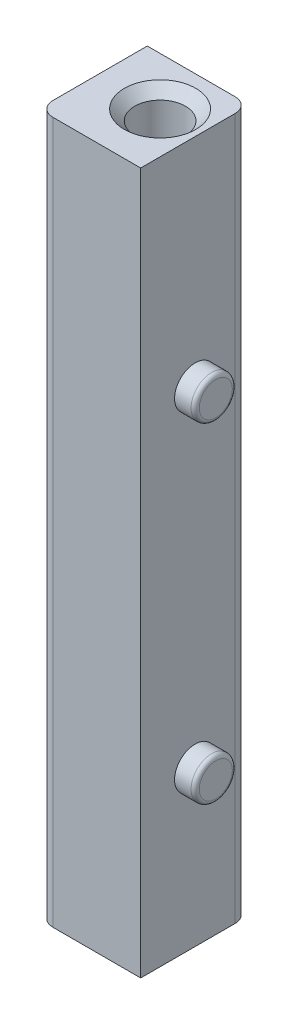
ISO-10303-21;
HEADER;
FILE_DESCRIPTION(('STEP AP214'),'2;1');
FILE_NAME('part.step','',(''),(''),'','','');
FILE_SCHEMA(('AUTOMOTIVE_DESIGN { 1 0 10303 214 1 1 1 1 }'));
ENDSEC;
DATA;
#1=APPLICATION_CONTEXT('core data for automotive mechanical design processes');
#2=APPLICATION_PROTOCOL_DEFINITION('international standard','automotive_design',2000,#1);
#3=PRODUCT_CONTEXT('',#1,'mechanical');
#4=PRODUCT('Part','Part','',(#3));
#5=PRODUCT_RELATED_PRODUCT_CATEGORY('part','',(#4));
#6=PRODUCT_DEFINITION_FORMATION('','',#4);
#7=PRODUCT_DEFINITION_CONTEXT('part definition',#1,'design');
#8=PRODUCT_DEFINITION('design','',#6,#7);
#9=PRODUCT_DEFINITION_SHAPE('','',#8);
#10=(LENGTH_UNIT() NAMED_UNIT(*) SI_UNIT(.MILLI.,.METRE.));
#11=(NAMED_UNIT(*) PLANE_ANGLE_UNIT() SI_UNIT($,.RADIAN.));
#12=(NAMED_UNIT(*) SI_UNIT($,.STERADIAN.) SOLID_ANGLE_UNIT());
#13=UNCERTAINTY_MEASURE_WITH_UNIT(LENGTH_MEASURE(1.E-05),#10,'distance_accuracy_value','');
#14=(GEOMETRIC_REPRESENTATION_CONTEXT(3) GLOBAL_UNCERTAINTY_ASSIGNED_CONTEXT((#13)) GLOBAL_UNIT_ASSIGNED_CONTEXT((#10,
#11,#12)) REPRESENTATION_CONTEXT('',''));
#15=CARTESIAN_POINT('',(0.,0.,0.));
#16=DIRECTION('',(0.,0.,1.));
#17=DIRECTION('',(1.,0.,0.));
#18=AXIS2_PLACEMENT_3D('',#15,#16,#17);
#19=CARTESIAN_POINT('',(5.1054,-39.37,-5.9182));
#20=DIRECTION('',(1.,0.,0.));
#21=DIRECTION('',(0.,0.,-1.));
#22=AXIS2_PLACEMENT_3D('',#19,#20,#21);
#23=PLANE('',#22);
#24=CARTESIAN_POINT('',(5.1054,20.32,0.787400000000002));
#25=DIRECTION('',(1.,0.,0.));
#26=DIRECTION('',(0.,0.,-1.));
#27=AXIS2_PLACEMENT_3D('',#24,#25,#26);
#28=CIRCLE('',#27,2.54);
#29=CARTESIAN_POINT('',(5.1054,20.32,-1.7526));
#30=VERTEX_POINT('',#29);
#31=EDGE_CURVE('E133',#30,#30,#28,.T.);
#32=ORIENTED_EDGE('',*,*,#31,.F.);
#33=EDGE_LOOP('',(#32));
#34=FACE_BOUND('',#33,.T.);
#35=DIRECTION('',(0.,0.,-1.));
#36=VECTOR('',#35,1.);
#37=CARTESIAN_POINT('',(5.1054,-39.37,-5.9182));
#38=LINE('',#37,#36);
#39=CARTESIAN_POINT('',(5.1054,-39.37,7.493));
#40=VERTEX_POINT('',#39);
#41=CARTESIAN_POINT('',(5.1054,-39.37,-4.1402));
#42=VERTEX_POINT('',#41);
#43=EDGE_CURVE('E122',#40,#42,#38,.T.);
#44=ORIENTED_EDGE('',*,*,#43,.T.);
#45=DIRECTION('',(0.,1.,0.));
#46=VECTOR('',#45,1.);
#47=CARTESIAN_POINT('',(5.1054,-39.37,-4.1402));
#48=LINE('',#47,#46);
#49=CARTESIAN_POINT('',(5.1054,46.99,-4.1402));
#50=VERTEX_POINT('',#49);
#51=EDGE_CURVE('E112',#42,#50,#48,.T.);
#52=ORIENTED_EDGE('',*,*,#51,.T.);
#53=DIRECTION('',(0.,0.,-1.));
#54=VECTOR('',#53,1.);
#55=CARTESIAN_POINT('',(5.1054,46.99,-5.9182));
#56=LINE('',#55,#54);
#57=CARTESIAN_POINT('',(5.1054,46.99,7.493));
#58=VERTEX_POINT('',#57);
#59=EDGE_CURVE('E94',#58,#50,#56,.T.);
#60=ORIENTED_EDGE('',*,*,#59,.F.);
#61=DIRECTION('',(0.,1.,0.));
#62=VECTOR('',#61,1.);
#63=CARTESIAN_POINT('',(5.1054,-39.37,7.493));
#64=LINE('',#63,#62);
#65=EDGE_CURVE('E101',#40,#58,#64,.T.);
#66=ORIENTED_EDGE('',*,*,#65,.F.);
#67=EDGE_LOOP('',(#44,#52,#60,#66));
#68=FACE_BOUND('',#67,.T.);
#69=CARTESIAN_POINT('',(5.1054,-20.32,0.787400000000002));
#70=DIRECTION('',(1.,0.,0.));
#71=DIRECTION('',(0.,0.,-1.));
#72=AXIS2_PLACEMENT_3D('',#69,#70,#71);
#73=CIRCLE('',#72,2.54);
#74=CARTESIAN_POINT('',(5.1054,-20.32,-1.7526));
#75=VERTEX_POINT('',#74);
#76=EDGE_CURVE('E208',#75,#75,#73,.T.);
#77=ORIENTED_EDGE('',*,*,#76,.F.);
#78=EDGE_LOOP('',(#77));
#79=FACE_BOUND('',#78,.T.);
#80=ADVANCED_FACE('F34',(#34,#68,#79),#23,.T.);
#81=CARTESIAN_POINT('',(-7.493,-39.37,-5.9182));
#82=DIRECTION('',(-1.,0.,0.));
#83=DIRECTION('',(0.,0.,1.));
#84=AXIS2_PLACEMENT_3D('',#81,#82,#83);
#85=PLANE('',#84);
#86=DIRECTION('',(0.,0.,1.));
#87=VECTOR('',#86,1.);
#88=CARTESIAN_POINT('',(-7.493,-39.37,-5.9182));
#89=LINE('',#88,#87);
#90=CARTESIAN_POINT('',(-7.493,-39.37,-5.9182));
#91=VERTEX_POINT('',#90);
#92=CARTESIAN_POINT('',(-7.493,-39.37,5.715));
#93=VERTEX_POINT('',#92);
#94=EDGE_CURVE('E115',#91,#93,#89,.T.);
#95=ORIENTED_EDGE('',*,*,#94,.T.);
#96=DIRECTION('',(0.,1.,0.));
#97=VECTOR('',#96,1.);
#98=CARTESIAN_POINT('',(-7.493,-39.37,5.715));
#99=LINE('',#98,#97);
#100=CARTESIAN_POINT('',(-7.493,46.99,5.715));
#101=VERTEX_POINT('',#100);
#102=EDGE_CURVE('E142',#93,#101,#99,.T.);
#103=ORIENTED_EDGE('',*,*,#102,.T.);
#104=DIRECTION('',(0.,0.,1.));
#105=VECTOR('',#104,1.);
#106=CARTESIAN_POINT('',(-7.493,46.99,-5.9182));
#107=LINE('',#106,#105);
#108=CARTESIAN_POINT('',(-7.493,46.99,-5.9182));
#109=VERTEX_POINT('',#108);
#110=EDGE_CURVE('E98',#109,#101,#107,.T.);
#111=ORIENTED_EDGE('',*,*,#110,.F.);
#112=DIRECTION('',(0.,1.,0.));
#113=VECTOR('',#112,1.);
#114=CARTESIAN_POINT('',(-7.493,-39.37,-5.9182));
#115=LINE('',#114,#113);
#116=EDGE_CURVE('E106',#91,#109,#115,.T.);
#117=ORIENTED_EDGE('',*,*,#116,.F.);
#118=EDGE_LOOP('',(#95,#103,#111,#117));
#119=FACE_BOUND('',#118,.T.);
#120=ADVANCED_FACE('F170',(#119),#85,.T.);
#121=CARTESIAN_POINT('',(-7.493,-39.37,-5.9182));
#122=DIRECTION('',(0.,0.,-1.));
#123=DIRECTION('',(-1.,0.,0.));
#124=AXIS2_PLACEMENT_3D('',#121,#122,#123);
#125=PLANE('',#124);
#126=DIRECTION('',(-1.,0.,0.));
#127=VECTOR('',#126,1.);
#128=CARTESIAN_POINT('',(-7.493,46.99,-5.9182));
#129=LINE('',#128,#127);
#130=CARTESIAN_POINT('',(3.3274,46.99,-5.9182));
#131=VERTEX_POINT('',#130);
#132=EDGE_CURVE('E113',#131,#109,#129,.T.);
#133=ORIENTED_EDGE('',*,*,#132,.F.);
#134=DIRECTION('',(0.,1.,0.));
#135=VECTOR('',#134,1.);
#136=CARTESIAN_POINT('',(3.3274,-39.37,-5.9182));
#137=LINE('',#136,#135);
#138=CARTESIAN_POINT('',(3.3274,-39.37,-5.9182));
#139=VERTEX_POINT('',#138);
#140=EDGE_CURVE('E57',#131,#139,#137,.F.);
#141=ORIENTED_EDGE('',*,*,#140,.T.);
#142=DIRECTION('',(-1.,0.,0.));
#143=VECTOR('',#142,1.);
#144=CARTESIAN_POINT('',(-7.493,-39.37,-5.9182));
#145=LINE('',#144,#143);
#146=EDGE_CURVE('E107',#139,#91,#145,.T.);
#147=ORIENTED_EDGE('',*,*,#146,.T.);
#148=ORIENTED_EDGE('',*,*,#116,.T.);
#149=EDGE_LOOP('',(#133,#141,#147,#148));
#150=FACE_BOUND('',#149,.T.);
#151=ADVANCED_FACE('F176',(#150),#125,.T.);
#152=CARTESIAN_POINT('',(-7.493,-39.37,7.493));
#153=DIRECTION('',(0.,0.,1.));
#154=DIRECTION('',(1.,0.,0.));
#155=AXIS2_PLACEMENT_3D('',#152,#153,#154);
#156=PLANE('',#155);
#157=DIRECTION('',(1.,0.,0.));
#158=VECTOR('',#157,1.);
#159=CARTESIAN_POINT('',(-7.493,46.99,7.493));
#160=LINE('',#159,#158);
#161=CARTESIAN_POINT('',(-5.715,46.99,7.493));
#162=VERTEX_POINT('',#161);
#163=EDGE_CURVE('E89',#162,#58,#160,.T.);
#164=ORIENTED_EDGE('',*,*,#163,.F.);
#165=DIRECTION('',(0.,1.,0.));
#166=VECTOR('',#165,1.);
#167=CARTESIAN_POINT('',(-5.715,-39.37,7.493));
#168=LINE('',#167,#166);
#169=CARTESIAN_POINT('',(-5.715,-39.37,7.493));
#170=VERTEX_POINT('',#169);
#171=EDGE_CURVE('E148',#162,#170,#168,.F.);
#172=ORIENTED_EDGE('',*,*,#171,.T.);
#173=DIRECTION('',(1.,0.,0.));
#174=VECTOR('',#173,1.);
#175=CARTESIAN_POINT('',(-7.493,-39.37,7.493));
#176=LINE('',#175,#174);
#177=EDGE_CURVE('E104',#170,#40,#176,.T.);
#178=ORIENTED_EDGE('',*,*,#177,.T.);
#179=ORIENTED_EDGE('',*,*,#65,.T.);
#180=EDGE_LOOP('',(#164,#172,#178,#179));
#181=FACE_BOUND('',#180,.T.);
#182=ADVANCED_FACE('F102',(#181),#156,.T.);
#183=CARTESIAN_POINT('',(-7.493,-39.37,7.493));
#184=DIRECTION('',(0.,1.,0.));
#185=DIRECTION('',(0.,0.,1.));
#186=AXIS2_PLACEMENT_3D('',#183,#184,#185);
#187=PLANE('',#186);
#188=CARTESIAN_POINT('',(0.,-39.37,0.));
#189=DIRECTION('',(0.,1.,0.));
#190=DIRECTION('',(0.,0.,1.));
#191=AXIS2_PLACEMENT_3D('',#188,#189,#190);
#192=CIRCLE('',#191,3.1242);
#193=CARTESIAN_POINT('',(0.,-39.37,3.1242));
#194=VERTEX_POINT('',#193);
#195=EDGE_CURVE('E206',#194,#194,#192,.T.);
#196=ORIENTED_EDGE('',*,*,#195,.T.);
#197=EDGE_LOOP('',(#196));
#198=FACE_BOUND('',#197,.T.);
#199=ORIENTED_EDGE('',*,*,#177,.F.);
#200=CARTESIAN_POINT('',(-5.715,-39.37,5.715));
#201=DIRECTION('',(0.,1.,0.));
#202=DIRECTION('',(0.,0.,1.));
#203=AXIS2_PLACEMENT_3D('',#200,#201,#202);
#204=CIRCLE('',#203,1.778);
#205=EDGE_CURVE('E151',#170,#93,#204,.F.);
#206=ORIENTED_EDGE('',*,*,#205,.T.);
#207=ORIENTED_EDGE('',*,*,#94,.F.);
#208=ORIENTED_EDGE('',*,*,#146,.F.);
#209=CARTESIAN_POINT('',(3.3274,-39.37,-4.1402));
#210=DIRECTION('',(0.,1.,0.));
#211=DIRECTION('',(0.,0.,1.));
#212=AXIS2_PLACEMENT_3D('',#209,#210,#211);
#213=CIRCLE('',#212,1.778);
#214=EDGE_CURVE('E49',#139,#42,#213,.F.);
#215=ORIENTED_EDGE('',*,*,#214,.T.);
#216=ORIENTED_EDGE('',*,*,#43,.F.);
#217=EDGE_LOOP('',(#199,#206,#207,#208,#215,#216));
#218=FACE_BOUND('',#217,.T.);
#219=ADVANCED_FACE('F184',(#198,#218),#187,.F.);
#220=CARTESIAN_POINT('',(-7.493,46.99,7.493));
#221=DIRECTION('',(0.,1.,0.));
#222=DIRECTION('',(0.,0.,1.));
#223=AXIS2_PLACEMENT_3D('',#220,#221,#222);
#224=PLANE('',#223);
#225=CARTESIAN_POINT('',(0.,46.99,0.));
#226=DIRECTION('',(0.,1.,0.));
#227=DIRECTION('',(0.,0.,1.));
#228=AXIS2_PLACEMENT_3D('',#225,#226,#227);
#229=CIRCLE('',#228,4.39419999999997);
#230=CARTESIAN_POINT('',(0.,46.99,4.39419999999997));
#231=VERTEX_POINT('',#230);
#232=EDGE_CURVE('E11',#231,#231,#229,.F.);
#233=ORIENTED_EDGE('',*,*,#232,.T.);
#234=EDGE_LOOP('',(#233));
#235=FACE_BOUND('',#234,.T.);
#236=ORIENTED_EDGE('',*,*,#110,.T.);
#237=CARTESIAN_POINT('',(-5.715,46.99,5.715));
#238=DIRECTION('',(0.,1.,0.));
#239=DIRECTION('',(0.,0.,1.));
#240=AXIS2_PLACEMENT_3D('',#237,#238,#239);
#241=CIRCLE('',#240,1.778);
#242=EDGE_CURVE('E95',#101,#162,#241,.T.);
#243=ORIENTED_EDGE('',*,*,#242,.T.);
#244=ORIENTED_EDGE('',*,*,#163,.T.);
#245=ORIENTED_EDGE('',*,*,#59,.T.);
#246=CARTESIAN_POINT('',(3.3274,46.99,-4.1402));
#247=DIRECTION('',(0.,1.,0.));
#248=DIRECTION('',(0.,0.,1.));
#249=AXIS2_PLACEMENT_3D('',#246,#247,#248);
#250=CIRCLE('',#249,1.778);
#251=EDGE_CURVE('E145',#50,#131,#250,.T.);
#252=ORIENTED_EDGE('',*,*,#251,.T.);
#253=ORIENTED_EDGE('',*,*,#132,.T.);
#254=EDGE_LOOP('',(#236,#243,#244,#245,#252,#253));
#255=FACE_BOUND('',#254,.T.);
#256=ADVANCED_FACE('F92',(#235,#255),#224,.T.);
#257=CARTESIAN_POINT('',(0.,-39.37,0.));
#258=DIRECTION('',(0.,1.,0.));
#259=DIRECTION('',(0.,0.,1.));
#260=AXIS2_PLACEMENT_3D('',#257,#258,#259);
#261=CYLINDRICAL_SURFACE('',#260,3.1242);
#262=CARTESIAN_POINT('',(0.,45.72,0.));
#263=DIRECTION('',(0.,1.,0.));
#264=DIRECTION('',(0.,0.,1.));
#265=AXIS2_PLACEMENT_3D('',#262,#263,#264);
#266=CIRCLE('',#265,3.1242);
#267=CARTESIAN_POINT('',(0.,45.72,3.1242));
#268=VERTEX_POINT('',#267);
#269=EDGE_CURVE('E42',#268,#268,#266,.T.);
#270=ORIENTED_EDGE('',*,*,#269,.T.);
#271=EDGE_LOOP('',(#270));
#272=FACE_BOUND('',#271,.T.);
#273=ORIENTED_EDGE('',*,*,#195,.F.);
#274=EDGE_LOOP('',(#273));
#275=FACE_BOUND('',#274,.T.);
#276=ADVANCED_FACE('F157',(#272,#275),#261,.F.);
#277=CARTESIAN_POINT('',(7.6454,-20.32,0.787400000000002));
#278=DIRECTION('',(-1.,0.,0.));
#279=DIRECTION('',(0.,0.,1.));
#280=AXIS2_PLACEMENT_3D('',#277,#278,#279);
#281=CYLINDRICAL_SURFACE('',#280,2.54);
#282=CARTESIAN_POINT('',(7.1374,-20.32,0.787400000000002));
#283=DIRECTION('',(1.,0.,0.));
#284=DIRECTION('',(0.,0.,-1.));
#285=AXIS2_PLACEMENT_3D('',#282,#283,#284);
#286=CIRCLE('',#285,2.54);
#287=CARTESIAN_POINT('',(7.1374,-20.32,-1.7526));
#288=VERTEX_POINT('',#287);
#289=EDGE_CURVE('E130',#288,#288,#286,.F.);
#290=ORIENTED_EDGE('',*,*,#289,.T.);
#291=EDGE_LOOP('',(#290));
#292=FACE_BOUND('',#291,.T.);
#293=ORIENTED_EDGE('',*,*,#76,.T.);
#294=EDGE_LOOP('',(#293));
#295=FACE_BOUND('',#294,.T.);
#296=ADVANCED_FACE('F214',(#292,#295),#281,.T.);
#297=CARTESIAN_POINT('',(7.6454,-20.32,0.787400000000002));
#298=DIRECTION('',(1.,0.,0.));
#299=DIRECTION('',(0.,0.,-1.));
#300=AXIS2_PLACEMENT_3D('',#297,#298,#299);
#301=PLANE('',#300);
#302=CARTESIAN_POINT('',(7.6454,-20.32,0.787400000000002));
#303=DIRECTION('',(1.,0.,0.));
#304=DIRECTION('',(0.,0.,-1.));
#305=AXIS2_PLACEMENT_3D('',#302,#303,#304);
#306=CIRCLE('',#305,2.032);
#307=CARTESIAN_POINT('',(7.6454,-20.32,-1.2446));
#308=VERTEX_POINT('',#307);
#309=EDGE_CURVE('E126',#308,#308,#306,.T.);
#310=ORIENTED_EDGE('',*,*,#309,.T.);
#311=EDGE_LOOP('',(#310));
#312=FACE_BOUND('',#311,.T.);
#313=ADVANCED_FACE('F190',(#312),#301,.T.);
#314=CARTESIAN_POINT('',(7.1374,-20.32,0.787400000000002));
#315=DIRECTION('',(1.,0.,0.));
#316=DIRECTION('',(0.,0.,-1.));
#317=AXIS2_PLACEMENT_3D('',#314,#315,#316);
#318=TOROIDAL_SURFACE('',#317,2.032,0.508);
#319=ORIENTED_EDGE('',*,*,#289,.F.);
#320=EDGE_LOOP('',(#319));
#321=FACE_BOUND('',#320,.T.);
#322=ORIENTED_EDGE('',*,*,#309,.F.);
#323=EDGE_LOOP('',(#322));
#324=FACE_BOUND('',#323,.T.);
#325=ADVANCED_FACE('F186',(#321,#324),#318,.T.);
#326=CARTESIAN_POINT('',(7.6454,20.32,0.787400000000002));
#327=DIRECTION('',(-1.,0.,0.));
#328=DIRECTION('',(0.,0.,1.));
#329=AXIS2_PLACEMENT_3D('',#326,#327,#328);
#330=CYLINDRICAL_SURFACE('',#329,2.54);
#331=CARTESIAN_POINT('',(7.1374,20.32,0.787400000000002));
#332=DIRECTION('',(1.,0.,0.));
#333=DIRECTION('',(0.,0.,-1.));
#334=AXIS2_PLACEMENT_3D('',#331,#332,#333);
#335=CIRCLE('',#334,2.54);
#336=CARTESIAN_POINT('',(7.1374,20.32,-1.7526));
#337=VERTEX_POINT('',#336);
#338=EDGE_CURVE('E136',#337,#337,#335,.F.);
#339=ORIENTED_EDGE('',*,*,#338,.T.);
#340=EDGE_LOOP('',(#339));
#341=FACE_BOUND('',#340,.T.);
#342=ORIENTED_EDGE('',*,*,#31,.T.);
#343=EDGE_LOOP('',(#342));
#344=FACE_BOUND('',#343,.T.);
#345=ADVANCED_FACE('F189',(#341,#344),#330,.T.);
#346=CARTESIAN_POINT('',(7.6454,20.32,0.787400000000002));
#347=DIRECTION('',(1.,0.,0.));
#348=DIRECTION('',(0.,0.,-1.));
#349=AXIS2_PLACEMENT_3D('',#346,#347,#348);
#350=PLANE('',#349);
#351=CARTESIAN_POINT('',(7.6454,20.32,0.787400000000002));
#352=DIRECTION('',(1.,0.,0.));
#353=DIRECTION('',(0.,0.,-1.));
#354=AXIS2_PLACEMENT_3D('',#351,#352,#353);
#355=CIRCLE('',#354,2.032);
#356=CARTESIAN_POINT('',(7.6454,20.32,-1.2446));
#357=VERTEX_POINT('',#356);
#358=EDGE_CURVE('E139',#357,#357,#355,.T.);
#359=ORIENTED_EDGE('',*,*,#358,.T.);
#360=EDGE_LOOP('',(#359));
#361=FACE_BOUND('',#360,.T.);
#362=ADVANCED_FACE('F195',(#361),#350,.T.);
#363=CARTESIAN_POINT('',(7.1374,20.32,0.787400000000002));
#364=DIRECTION('',(1.,0.,0.));
#365=DIRECTION('',(0.,0.,-1.));
#366=AXIS2_PLACEMENT_3D('',#363,#364,#365);
#367=TOROIDAL_SURFACE('',#366,2.032,0.508);
#368=ORIENTED_EDGE('',*,*,#358,.F.);
#369=EDGE_LOOP('',(#368));
#370=FACE_BOUND('',#369,.T.);
#371=ORIENTED_EDGE('',*,*,#338,.F.);
#372=EDGE_LOOP('',(#371));
#373=FACE_BOUND('',#372,.T.);
#374=ADVANCED_FACE('F192',(#370,#373),#367,.T.);
#375=CARTESIAN_POINT('',(-5.715,-39.37,5.715));
#376=DIRECTION('',(0.,1.,0.));
#377=DIRECTION('',(0.,0.,1.));
#378=AXIS2_PLACEMENT_3D('',#375,#376,#377);
#379=CYLINDRICAL_SURFACE('',#378,1.778);
#380=ORIENTED_EDGE('',*,*,#205,.F.);
#381=ORIENTED_EDGE('',*,*,#171,.F.);
#382=ORIENTED_EDGE('',*,*,#242,.F.);
#383=ORIENTED_EDGE('',*,*,#102,.F.);
#384=EDGE_LOOP('',(#380,#381,#382,#383));
#385=FACE_BOUND('',#384,.T.);
#386=ADVANCED_FACE('F166',(#385),#379,.T.);
#387=CARTESIAN_POINT('',(3.3274,-39.37,-4.1402));
#388=DIRECTION('',(0.,1.,0.));
#389=DIRECTION('',(0.,0.,1.));
#390=AXIS2_PLACEMENT_3D('',#387,#388,#389);
#391=CYLINDRICAL_SURFACE('',#390,1.778);
#392=ORIENTED_EDGE('',*,*,#214,.F.);
#393=ORIENTED_EDGE('',*,*,#140,.F.);
#394=ORIENTED_EDGE('',*,*,#251,.F.);
#395=ORIENTED_EDGE('',*,*,#51,.F.);
#396=EDGE_LOOP('',(#392,#393,#394,#395));
#397=FACE_BOUND('',#396,.T.);
#398=ADVANCED_FACE('F161',(#397),#391,.T.);
#399=CARTESIAN_POINT('',(0.,45.72,0.));
#400=DIRECTION('',(0.,1.,0.));
#401=DIRECTION('',(0.,0.,1.));
#402=AXIS2_PLACEMENT_3D('',#399,#400,#401);
#403=CONICAL_SURFACE('',#402,3.1242,0.785398163397451);
#404=ORIENTED_EDGE('',*,*,#232,.F.);
#405=EDGE_LOOP('',(#404));
#406=FACE_BOUND('',#405,.T.);
#407=ORIENTED_EDGE('',*,*,#269,.F.);
#408=EDGE_LOOP('',(#407));
#409=FACE_BOUND('',#408,.T.);
#410=ADVANCED_FACE('F36',(#406,#409),#403,.F.);
#411=CLOSED_SHELL('',(#80,#120,#151,#182,#219,#256,#276,#296,#313,#325,#345,#362,#374,#386,#398,#410));
#412=MANIFOLD_SOLID_BREP('B2',#411);
#413=ADVANCED_BREP_SHAPE_REPRESENTATION('',(#18,#412),#14);
#414=SHAPE_DEFINITION_REPRESENTATION(#9,#413);
ENDSEC;
END-ISO-10303-21;
